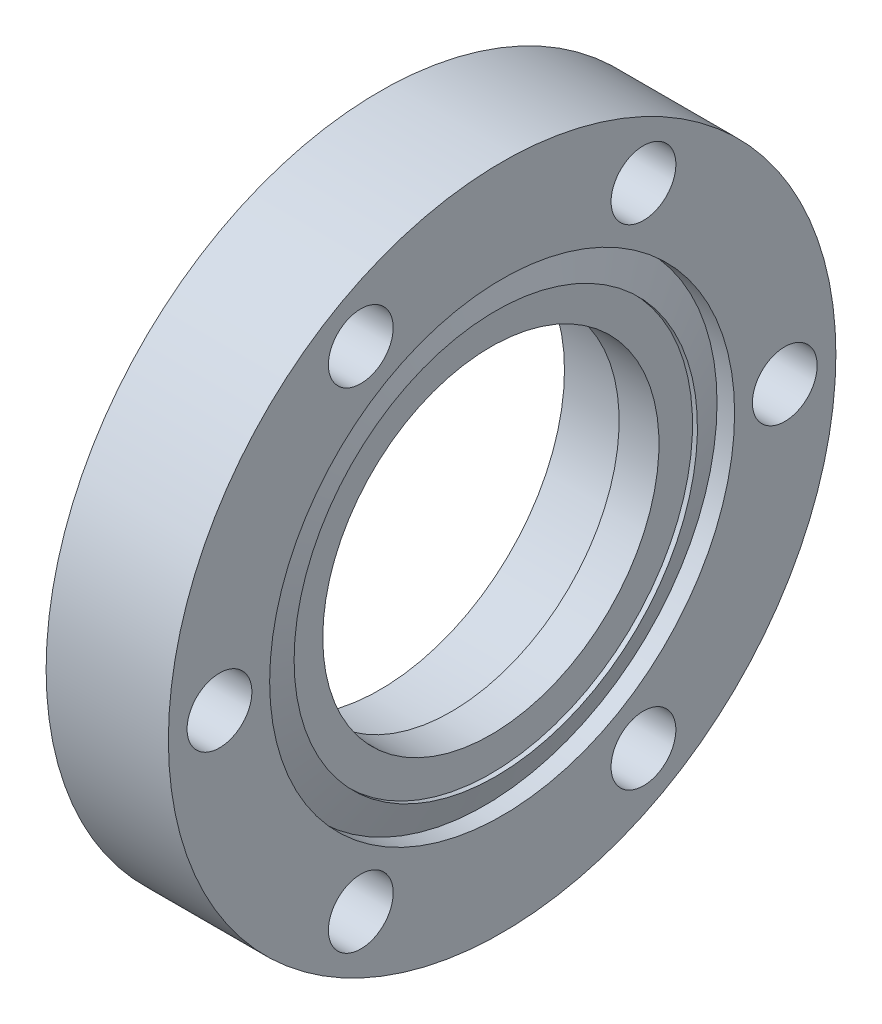
ISO-10303-21;
HEADER;
FILE_DESCRIPTION(('STEP AP214'),'2;1');
FILE_NAME('part.step','',(''),(''),'','','');
FILE_SCHEMA(('AUTOMOTIVE_DESIGN { 1 0 10303 214 1 1 1 1 }'));
ENDSEC;
DATA;
#1=APPLICATION_CONTEXT('core data for automotive mechanical design processes');
#2=APPLICATION_PROTOCOL_DEFINITION('international standard','automotive_design',2000,#1);
#3=PRODUCT_CONTEXT('',#1,'mechanical');
#4=PRODUCT('Part','Part','',(#3));
#5=PRODUCT_RELATED_PRODUCT_CATEGORY('part','',(#4));
#6=PRODUCT_DEFINITION_FORMATION('','',#4);
#7=PRODUCT_DEFINITION_CONTEXT('part definition',#1,'design');
#8=PRODUCT_DEFINITION('design','',#6,#7);
#9=PRODUCT_DEFINITION_SHAPE('','',#8);
#10=(LENGTH_UNIT() NAMED_UNIT(*) SI_UNIT(.MILLI.,.METRE.));
#11=(NAMED_UNIT(*) PLANE_ANGLE_UNIT() SI_UNIT($,.RADIAN.));
#12=(NAMED_UNIT(*) SI_UNIT($,.STERADIAN.) SOLID_ANGLE_UNIT());
#13=UNCERTAINTY_MEASURE_WITH_UNIT(LENGTH_MEASURE(1.E-05),#10,'distance_accuracy_value','');
#14=(GEOMETRIC_REPRESENTATION_CONTEXT(3) GLOBAL_UNCERTAINTY_ASSIGNED_CONTEXT((#13)) GLOBAL_UNIT_ASSIGNED_CONTEXT((#10,
#11,#12)) REPRESENTATION_CONTEXT('',''));
#15=CARTESIAN_POINT('',(0.,0.,0.));
#16=DIRECTION('',(0.,0.,1.));
#17=DIRECTION('',(1.,0.,0.));
#18=AXIS2_PLACEMENT_3D('',#15,#16,#17);
#19=CARTESIAN_POINT('',(5.18000000000051,-19.2062500000005,0.));
#20=DIRECTION('',(1.,0.,0.));
#21=DIRECTION('',(0.,0.,-1.));
#22=AXIS2_PLACEMENT_3D('',#19,#20,#21);
#23=PLANE('',#22);
#24=CARTESIAN_POINT('',(5.18000000000051,0.,0.));
#25=DIRECTION('',(-1.,0.,0.));
#26=DIRECTION('',(0.,0.,1.));
#27=AXIS2_PLACEMENT_3D('',#24,#25,#26);
#28=CIRCLE('',#27,17.4625);
#29=CARTESIAN_POINT('',(5.18000000000051,0.,17.4625));
#30=VERTEX_POINT('',#29);
#31=EDGE_CURVE('E18',#30,#30,#28,.T.);
#32=ORIENTED_EDGE('',*,*,#31,.T.);
#33=EDGE_LOOP('',(#32));
#34=FACE_BOUND('',#33,.T.);
#35=CARTESIAN_POINT('',(5.18000000000051,0.,0.));
#36=DIRECTION('',(-1.,0.,0.));
#37=DIRECTION('',(0.,0.,1.));
#38=AXIS2_PLACEMENT_3D('',#35,#36,#37);
#39=CIRCLE('',#38,20.950000000001);
#40=CARTESIAN_POINT('',(5.18000000000051,0.,20.950000000001));
#41=VERTEX_POINT('',#40);
#42=EDGE_CURVE('E81',#41,#41,#39,.F.);
#43=ORIENTED_EDGE('',*,*,#42,.T.);
#44=EDGE_LOOP('',(#43));
#45=FACE_BOUND('',#44,.T.);
#46=ADVANCED_FACE('F14',(#34,#45),#23,.T.);
#47=CARTESIAN_POINT('',(3.11069999999995,0.,0.));
#48=DIRECTION('',(-1.,0.,0.));
#49=DIRECTION('',(0.,0.,1.));
#50=AXIS2_PLACEMENT_3D('',#47,#48,#49);
#51=CYLINDRICAL_SURFACE('',#50,17.4625);
#52=CARTESIAN_POINT('',(1.04139999999939,0.,0.));
#53=DIRECTION('',(-1.,0.,0.));
#54=DIRECTION('',(0.,0.,1.));
#55=AXIS2_PLACEMENT_3D('',#52,#53,#54);
#56=CIRCLE('',#55,17.4625);
#57=CARTESIAN_POINT('',(1.04139999999939,0.,17.4625));
#58=VERTEX_POINT('',#57);
#59=EDGE_CURVE('E79',#58,#58,#56,.F.);
#60=ORIENTED_EDGE('',*,*,#59,.F.);
#61=EDGE_LOOP('',(#60));
#62=FACE_BOUND('',#61,.T.);
#63=ORIENTED_EDGE('',*,*,#31,.F.);
#64=EDGE_LOOP('',(#63));
#65=FACE_BOUND('',#64,.T.);
#66=ADVANCED_FACE('F89',(#62,#65),#51,.F.);
#67=CARTESIAN_POINT('',(5.43499999999988,0.,0.));
#68=DIRECTION('',(-1.,0.,0.));
#69=DIRECTION('',(0.,0.,1.));
#70=AXIS2_PLACEMENT_3D('',#67,#68,#69);
#71=CYLINDRICAL_SURFACE('',#70,20.950000000001);
#72=ORIENTED_EDGE('',*,*,#42,.F.);
#73=EDGE_LOOP('',(#72));
#74=FACE_BOUND('',#73,.T.);
#75=CARTESIAN_POINT('',(5.69000000223288,0.,0.));
#76=DIRECTION('',(-1.,0.,0.));
#77=DIRECTION('',(0.,-1.,0.));
#78=AXIS2_PLACEMENT_3D('',#75,#76,#77);
#79=CIRCLE('',#78,20.950000000814);
#80=CARTESIAN_POINT('',(5.69000000223288,-20.950000000814,0.));
#81=VERTEX_POINT('',#80);
#82=EDGE_CURVE('E78',#81,#81,#79,.T.);
#83=ORIENTED_EDGE('',*,*,#82,.F.);
#84=EDGE_LOOP('',(#83));
#85=FACE_BOUND('',#84,.T.);
#86=ADVANCED_FACE('F91',(#74,#85),#71,.F.);
#87=CARTESIAN_POINT('',(1.04139999999939,-18.3197499999999,0.));
#88=DIRECTION('',(-1.,0.,0.));
#89=DIRECTION('',(0.,0.,1.));
#90=AXIS2_PLACEMENT_3D('',#87,#88,#89);
#91=PLANE('',#90);
#92=ORIENTED_EDGE('',*,*,#59,.T.);
#93=EDGE_LOOP('',(#92));
#94=FACE_BOUND('',#93,.T.);
#95=CARTESIAN_POINT('',(1.04139999999939,0.,0.));
#96=DIRECTION('',(-1.,0.,0.));
#97=DIRECTION('',(0.,0.,1.));
#98=AXIS2_PLACEMENT_3D('',#95,#96,#97);
#99=CIRCLE('',#98,19.1769999999999);
#100=CARTESIAN_POINT('',(1.04139999999939,0.,19.1769999999999));
#101=VERTEX_POINT('',#100);
#102=EDGE_CURVE('E75',#101,#101,#99,.T.);
#103=ORIENTED_EDGE('',*,*,#102,.T.);
#104=EDGE_LOOP('',(#103));
#105=FACE_BOUND('',#104,.T.);
#106=ADVANCED_FACE('F100',(#94,#105),#91,.T.);
#107=CARTESIAN_POINT('',(4.52529524811392,0.,0.));
#108=DIRECTION('',(-1.,0.,0.));
#109=DIRECTION('',(0.,0.,1.));
#110=AXIS2_PLACEMENT_3D('',#107,#108,#109);
#111=CONICAL_SURFACE('',#110,24.1499999991873,1.22173047499998);
#112=ORIENTED_EDGE('',*,*,#82,.T.);
#113=EDGE_LOOP('',(#112));
#114=FACE_BOUND('',#113,.T.);
#115=CARTESIAN_POINT('',(4.52529525034756,0.,0.));
#116=DIRECTION('',(-1.,0.,0.));
#117=DIRECTION('',(0.,0.,1.));
#118=AXIS2_PLACEMENT_3D('',#115,#116,#117);
#119=CIRCLE('',#118,24.1500000000003);
#120=CARTESIAN_POINT('',(4.52529525034756,0.,24.1500000000003));
#121=VERTEX_POINT('',#120);
#122=EDGE_CURVE('E74',#121,#121,#119,.F.);
#123=ORIENTED_EDGE('',*,*,#122,.T.);
#124=EDGE_LOOP('',(#123));
#125=FACE_BOUND('',#124,.T.);
#126=ADVANCED_FACE('F129',(#114,#125),#111,.T.);
#127=CARTESIAN_POINT('',(-2.65429999999995,0.,0.));
#128=DIRECTION('',(-1.,0.,0.));
#129=DIRECTION('',(0.,0.,1.));
#130=AXIS2_PLACEMENT_3D('',#127,#128,#129);
#131=CYLINDRICAL_SURFACE('',#130,19.1769999999999);
#132=CARTESIAN_POINT('',(-6.34999999999929,0.,0.));
#133=DIRECTION('',(-1.,0.,0.));
#134=DIRECTION('',(0.,0.,1.));
#135=AXIS2_PLACEMENT_3D('',#132,#133,#134);
#136=CIRCLE('',#135,19.1769999999999);
#137=CARTESIAN_POINT('',(-6.34999999999929,0.,19.1769999999999));
#138=VERTEX_POINT('',#137);
#139=EDGE_CURVE('E53',#138,#138,#136,.F.);
#140=ORIENTED_EDGE('',*,*,#139,.F.);
#141=EDGE_LOOP('',(#140));
#142=FACE_BOUND('',#141,.T.);
#143=ORIENTED_EDGE('',*,*,#102,.F.);
#144=EDGE_LOOP('',(#143));
#145=FACE_BOUND('',#144,.T.);
#146=ADVANCED_FACE('F125',(#142,#145),#131,.F.);
#147=CARTESIAN_POINT('',(6.34999999999939,-25.4285843160799,14.6811999999998));
#148=DIRECTION('',(-1.,0.,0.));
#149=DIRECTION('',(0.,0.,1.));
#150=AXIS2_PLACEMENT_3D('',#147,#148,#149);
#151=CYLINDRICAL_SURFACE('',#150,3.36550000000002);
#152=CARTESIAN_POINT('',(6.34999999999937,-25.4285843160799,14.6811999999998));
#153=DIRECTION('',(-1.,0.,0.));
#154=DIRECTION('',(0.,0.,1.));
#155=AXIS2_PLACEMENT_3D('',#152,#153,#154);
#156=CIRCLE('',#155,3.36550000000002);
#157=CARTESIAN_POINT('',(6.34999999999937,-25.4285843160799,18.0466999999999));
#158=VERTEX_POINT('',#157);
#159=EDGE_CURVE('E50',#158,#158,#156,.T.);
#160=ORIENTED_EDGE('',*,*,#159,.F.);
#161=EDGE_LOOP('',(#160));
#162=FACE_BOUND('',#161,.T.);
#163=CARTESIAN_POINT('',(-6.34999999999929,-25.4285843160799,14.6811999999998));
#164=DIRECTION('',(-1.,0.,0.));
#165=DIRECTION('',(0.,0.,1.));
#166=AXIS2_PLACEMENT_3D('',#163,#164,#165);
#167=CIRCLE('',#166,3.36550000000002);
#168=CARTESIAN_POINT('',(-6.34999999999929,-25.4285843160799,18.0466999999999));
#169=VERTEX_POINT('',#168);
#170=EDGE_CURVE('E71',#169,#169,#167,.F.);
#171=ORIENTED_EDGE('',*,*,#170,.F.);
#172=EDGE_LOOP('',(#171));
#173=FACE_BOUND('',#172,.T.);
#174=ADVANCED_FACE('F128',(#162,#173),#151,.F.);
#175=CARTESIAN_POINT('',(6.34999999999939,0.,29.3623999999996));
#176=DIRECTION('',(-1.,0.,0.));
#177=DIRECTION('',(0.,0.,1.));
#178=AXIS2_PLACEMENT_3D('',#175,#176,#177);
#179=CYLINDRICAL_SURFACE('',#178,3.3655);
#180=CARTESIAN_POINT('',(6.34999999999937,0.,29.3623999999996));
#181=DIRECTION('',(-1.,0.,0.));
#182=DIRECTION('',(0.,0.,1.));
#183=AXIS2_PLACEMENT_3D('',#180,#181,#182);
#184=CIRCLE('',#183,3.3655);
#185=CARTESIAN_POINT('',(6.34999999999937,0.,32.7278999999996));
#186=VERTEX_POINT('',#185);
#187=EDGE_CURVE('E47',#186,#186,#184,.T.);
#188=ORIENTED_EDGE('',*,*,#187,.F.);
#189=EDGE_LOOP('',(#188));
#190=FACE_BOUND('',#189,.T.);
#191=CARTESIAN_POINT('',(-6.34999999999929,0.,29.3623999999996));
#192=DIRECTION('',(-1.,0.,0.));
#193=DIRECTION('',(0.,0.,1.));
#194=AXIS2_PLACEMENT_3D('',#191,#192,#193);
#195=CIRCLE('',#194,3.3655);
#196=CARTESIAN_POINT('',(-6.34999999999929,0.,32.7278999999996));
#197=VERTEX_POINT('',#196);
#198=EDGE_CURVE('E68',#197,#197,#195,.F.);
#199=ORIENTED_EDGE('',*,*,#198,.F.);
#200=EDGE_LOOP('',(#199));
#201=FACE_BOUND('',#200,.T.);
#202=ADVANCED_FACE('F170',(#190,#201),#179,.F.);
#203=CARTESIAN_POINT('',(6.34999999999939,25.4285843160799,14.6811999999998));
#204=DIRECTION('',(-1.,0.,0.));
#205=DIRECTION('',(0.,0.,1.));
#206=AXIS2_PLACEMENT_3D('',#203,#204,#205);
#207=CYLINDRICAL_SURFACE('',#206,3.36549999999999);
#208=CARTESIAN_POINT('',(6.34999999999937,25.4285843160799,14.6811999999998));
#209=DIRECTION('',(-1.,0.,0.));
#210=DIRECTION('',(0.,0.,1.));
#211=AXIS2_PLACEMENT_3D('',#208,#209,#210);
#212=CIRCLE('',#211,3.36549999999999);
#213=CARTESIAN_POINT('',(6.34999999999937,25.4285843160799,18.0466999999998));
#214=VERTEX_POINT('',#213);
#215=EDGE_CURVE('E44',#214,#214,#212,.T.);
#216=ORIENTED_EDGE('',*,*,#215,.F.);
#217=EDGE_LOOP('',(#216));
#218=FACE_BOUND('',#217,.T.);
#219=CARTESIAN_POINT('',(-6.34999999999929,25.4285843160799,14.6811999999998));
#220=DIRECTION('',(-1.,0.,0.));
#221=DIRECTION('',(0.,0.,1.));
#222=AXIS2_PLACEMENT_3D('',#219,#220,#221);
#223=CIRCLE('',#222,3.36549999999999);
#224=CARTESIAN_POINT('',(-6.34999999999929,25.4285843160799,18.0466999999998));
#225=VERTEX_POINT('',#224);
#226=EDGE_CURVE('E65',#225,#225,#223,.F.);
#227=ORIENTED_EDGE('',*,*,#226,.F.);
#228=EDGE_LOOP('',(#227));
#229=FACE_BOUND('',#228,.T.);
#230=ADVANCED_FACE('F179',(#218,#229),#207,.F.);
#231=CARTESIAN_POINT('',(6.34999999999939,25.4285843160799,-14.6811999999998));
#232=DIRECTION('',(-1.,0.,0.));
#233=DIRECTION('',(0.,0.,1.));
#234=AXIS2_PLACEMENT_3D('',#231,#232,#233);
#235=CYLINDRICAL_SURFACE('',#234,3.3655);
#236=CARTESIAN_POINT('',(6.34999999999937,25.4285843160799,-14.6811999999998));
#237=DIRECTION('',(-1.,0.,0.));
#238=DIRECTION('',(0.,0.,1.));
#239=AXIS2_PLACEMENT_3D('',#236,#237,#238);
#240=CIRCLE('',#239,3.3655);
#241=CARTESIAN_POINT('',(6.34999999999937,25.4285843160799,-11.3156999999998));
#242=VERTEX_POINT('',#241);
#243=EDGE_CURVE('E41',#242,#242,#240,.T.);
#244=ORIENTED_EDGE('',*,*,#243,.F.);
#245=EDGE_LOOP('',(#244));
#246=FACE_BOUND('',#245,.T.);
#247=CARTESIAN_POINT('',(-6.34999999999929,25.4285843160799,-14.6811999999998));
#248=DIRECTION('',(-1.,0.,0.));
#249=DIRECTION('',(0.,0.,1.));
#250=AXIS2_PLACEMENT_3D('',#247,#248,#249);
#251=CIRCLE('',#250,3.3655);
#252=CARTESIAN_POINT('',(-6.34999999999929,25.4285843160799,-11.3156999999998));
#253=VERTEX_POINT('',#252);
#254=EDGE_CURVE('E62',#253,#253,#251,.F.);
#255=ORIENTED_EDGE('',*,*,#254,.F.);
#256=EDGE_LOOP('',(#255));
#257=FACE_BOUND('',#256,.T.);
#258=ADVANCED_FACE('F188',(#246,#257),#235,.F.);
#259=CARTESIAN_POINT('',(6.34999999999939,-25.4285843160799,-14.6811999999998));
#260=DIRECTION('',(-1.,0.,0.));
#261=DIRECTION('',(0.,0.,1.));
#262=AXIS2_PLACEMENT_3D('',#259,#260,#261);
#263=CYLINDRICAL_SURFACE('',#262,3.3655);
#264=CARTESIAN_POINT('',(6.34999999999937,-25.4285843160799,-14.6811999999998));
#265=DIRECTION('',(-1.,0.,0.));
#266=DIRECTION('',(0.,0.,1.));
#267=AXIS2_PLACEMENT_3D('',#264,#265,#266);
#268=CIRCLE('',#267,3.3655);
#269=CARTESIAN_POINT('',(6.34999999999937,-25.4285843160799,-11.3156999999998));
#270=VERTEX_POINT('',#269);
#271=EDGE_CURVE('E38',#270,#270,#268,.T.);
#272=ORIENTED_EDGE('',*,*,#271,.F.);
#273=EDGE_LOOP('',(#272));
#274=FACE_BOUND('',#273,.T.);
#275=CARTESIAN_POINT('',(-6.34999999999929,-25.4285843160799,-14.6811999999998));
#276=DIRECTION('',(-1.,0.,0.));
#277=DIRECTION('',(0.,0.,1.));
#278=AXIS2_PLACEMENT_3D('',#275,#276,#277);
#279=CIRCLE('',#278,3.3655);
#280=CARTESIAN_POINT('',(-6.34999999999929,-25.4285843160799,-11.3156999999998));
#281=VERTEX_POINT('',#280);
#282=EDGE_CURVE('E59',#281,#281,#279,.F.);
#283=ORIENTED_EDGE('',*,*,#282,.F.);
#284=EDGE_LOOP('',(#283));
#285=FACE_BOUND('',#284,.T.);
#286=ADVANCED_FACE('F197',(#274,#285),#263,.F.);
#287=CARTESIAN_POINT('',(6.34999999999939,0.,-29.3623999999996));
#288=DIRECTION('',(-1.,0.,0.));
#289=DIRECTION('',(0.,0.,1.));
#290=AXIS2_PLACEMENT_3D('',#287,#288,#289);
#291=CYLINDRICAL_SURFACE('',#290,3.3655);
#292=CARTESIAN_POINT('',(6.34999999999937,0.,-29.3623999999996));
#293=DIRECTION('',(-1.,0.,0.));
#294=DIRECTION('',(0.,0.,1.));
#295=AXIS2_PLACEMENT_3D('',#292,#293,#294);
#296=CIRCLE('',#295,3.3655);
#297=CARTESIAN_POINT('',(6.34999999999937,0.,-25.9968999999996));
#298=VERTEX_POINT('',#297);
#299=EDGE_CURVE('E35',#298,#298,#296,.T.);
#300=ORIENTED_EDGE('',*,*,#299,.F.);
#301=EDGE_LOOP('',(#300));
#302=FACE_BOUND('',#301,.T.);
#303=CARTESIAN_POINT('',(-6.34999999999929,0.,-29.3623999999996));
#304=DIRECTION('',(-1.,0.,0.));
#305=DIRECTION('',(0.,0.,1.));
#306=AXIS2_PLACEMENT_3D('',#303,#304,#305);
#307=CIRCLE('',#306,3.3655);
#308=CARTESIAN_POINT('',(-6.34999999999929,0.,-25.9968999999996));
#309=VERTEX_POINT('',#308);
#310=EDGE_CURVE('E56',#309,#309,#307,.F.);
#311=ORIENTED_EDGE('',*,*,#310,.F.);
#312=EDGE_LOOP('',(#311));
#313=FACE_BOUND('',#312,.T.);
#314=ADVANCED_FACE('F16',(#302,#313),#291,.F.);
#315=CARTESIAN_POINT('',(5.43764762517347,0.,0.));
#316=DIRECTION('',(-1.,0.,0.));
#317=DIRECTION('',(0.,0.,1.));
#318=AXIS2_PLACEMENT_3D('',#315,#316,#317);
#319=CYLINDRICAL_SURFACE('',#318,24.1500000000003);
#320=ORIENTED_EDGE('',*,*,#122,.F.);
#321=EDGE_LOOP('',(#320));
#322=FACE_BOUND('',#321,.T.);
#323=CARTESIAN_POINT('',(6.34999999999937,0.,0.));
#324=DIRECTION('',(-1.,0.,0.));
#325=DIRECTION('',(0.,0.,1.));
#326=AXIS2_PLACEMENT_3D('',#323,#324,#325);
#327=CIRCLE('',#326,24.1500000000003);
#328=CARTESIAN_POINT('',(6.34999999999937,0.,24.1500000000003));
#329=VERTEX_POINT('',#328);
#330=EDGE_CURVE('E27',#329,#329,#327,.T.);
#331=ORIENTED_EDGE('',*,*,#330,.F.);
#332=EDGE_LOOP('',(#331));
#333=FACE_BOUND('',#332,.T.);
#334=ADVANCED_FACE('F120',(#322,#333),#319,.F.);
#335=CARTESIAN_POINT('',(-6.34999999999929,-26.9240000000001,0.));
#336=DIRECTION('',(-1.,0.,0.));
#337=DIRECTION('',(0.,0.,1.));
#338=AXIS2_PLACEMENT_3D('',#335,#336,#337);
#339=PLANE('',#338);
#340=ORIENTED_EDGE('',*,*,#139,.T.);
#341=EDGE_LOOP('',(#340));
#342=FACE_BOUND('',#341,.T.);
#343=ORIENTED_EDGE('',*,*,#310,.T.);
#344=EDGE_LOOP('',(#343));
#345=FACE_BOUND('',#344,.T.);
#346=ORIENTED_EDGE('',*,*,#282,.T.);
#347=EDGE_LOOP('',(#346));
#348=FACE_BOUND('',#347,.T.);
#349=ORIENTED_EDGE('',*,*,#254,.T.);
#350=EDGE_LOOP('',(#349));
#351=FACE_BOUND('',#350,.T.);
#352=ORIENTED_EDGE('',*,*,#226,.T.);
#353=EDGE_LOOP('',(#352));
#354=FACE_BOUND('',#353,.T.);
#355=ORIENTED_EDGE('',*,*,#198,.T.);
#356=EDGE_LOOP('',(#355));
#357=FACE_BOUND('',#356,.T.);
#358=ORIENTED_EDGE('',*,*,#170,.T.);
#359=EDGE_LOOP('',(#358));
#360=FACE_BOUND('',#359,.T.);
#361=CARTESIAN_POINT('',(-6.34999999999929,0.,0.));
#362=DIRECTION('',(-1.,0.,0.));
#363=DIRECTION('',(0.,0.,1.));
#364=AXIS2_PLACEMENT_3D('',#361,#362,#363);
#365=CIRCLE('',#364,34.6710000000003);
#366=CARTESIAN_POINT('',(-6.34999999999929,0.,34.6710000000003));
#367=VERTEX_POINT('',#366);
#368=EDGE_CURVE('E22',#367,#367,#365,.F.);
#369=ORIENTED_EDGE('',*,*,#368,.F.);
#370=EDGE_LOOP('',(#369));
#371=FACE_BOUND('',#370,.T.);
#372=ADVANCED_FACE('F113',(#342,#345,#348,#351,#354,#357,#360,#371),#339,.T.);
#373=CARTESIAN_POINT('',(6.34999999999937,-29.4105000000003,0.));
#374=DIRECTION('',(1.,0.,0.));
#375=DIRECTION('',(0.,0.,-1.));
#376=AXIS2_PLACEMENT_3D('',#373,#374,#375);
#377=PLANE('',#376);
#378=ORIENTED_EDGE('',*,*,#330,.T.);
#379=EDGE_LOOP('',(#378));
#380=FACE_BOUND('',#379,.T.);
#381=ORIENTED_EDGE('',*,*,#299,.T.);
#382=EDGE_LOOP('',(#381));
#383=FACE_BOUND('',#382,.T.);
#384=ORIENTED_EDGE('',*,*,#271,.T.);
#385=EDGE_LOOP('',(#384));
#386=FACE_BOUND('',#385,.T.);
#387=ORIENTED_EDGE('',*,*,#243,.T.);
#388=EDGE_LOOP('',(#387));
#389=FACE_BOUND('',#388,.T.);
#390=ORIENTED_EDGE('',*,*,#215,.T.);
#391=EDGE_LOOP('',(#390));
#392=FACE_BOUND('',#391,.T.);
#393=ORIENTED_EDGE('',*,*,#187,.T.);
#394=EDGE_LOOP('',(#393));
#395=FACE_BOUND('',#394,.T.);
#396=ORIENTED_EDGE('',*,*,#159,.T.);
#397=EDGE_LOOP('',(#396));
#398=FACE_BOUND('',#397,.T.);
#399=CARTESIAN_POINT('',(6.34999999999937,0.,0.));
#400=DIRECTION('',(-1.,0.,0.));
#401=DIRECTION('',(0.,0.,1.));
#402=AXIS2_PLACEMENT_3D('',#399,#400,#401);
#403=CIRCLE('',#402,34.6710000000003);
#404=CARTESIAN_POINT('',(6.34999999999937,0.,34.6710000000003));
#405=VERTEX_POINT('',#404);
#406=EDGE_CURVE('E10',#405,#405,#403,.T.);
#407=ORIENTED_EDGE('',*,*,#406,.F.);
#408=EDGE_LOOP('',(#407));
#409=FACE_BOUND('',#408,.T.);
#410=ADVANCED_FACE('F107',(#380,#383,#386,#389,#392,#395,#398,#409),#377,.T.);
#411=CARTESIAN_POINT('',(0.,0.,0.));
#412=DIRECTION('',(-1.,0.,0.));
#413=DIRECTION('',(0.,0.,1.));
#414=AXIS2_PLACEMENT_3D('',#411,#412,#413);
#415=CYLINDRICAL_SURFACE('',#414,34.6710000000003);
#416=ORIENTED_EDGE('',*,*,#406,.T.);
#417=EDGE_LOOP('',(#416));
#418=FACE_BOUND('',#417,.T.);
#419=ORIENTED_EDGE('',*,*,#368,.T.);
#420=EDGE_LOOP('',(#419));
#421=FACE_BOUND('',#420,.T.);
#422=ADVANCED_FACE('F105',(#418,#421),#415,.T.);
#423=CLOSED_SHELL('',(#46,#66,#86,#106,#126,#146,#174,#202,#230,#258,#286,#314,#334,#372,#410,#422));
#424=MANIFOLD_SOLID_BREP('B1',#423);
#425=ADVANCED_BREP_SHAPE_REPRESENTATION('',(#18,#424),#14);
#426=SHAPE_DEFINITION_REPRESENTATION(#9,#425);
ENDSEC;
END-ISO-10303-21;
